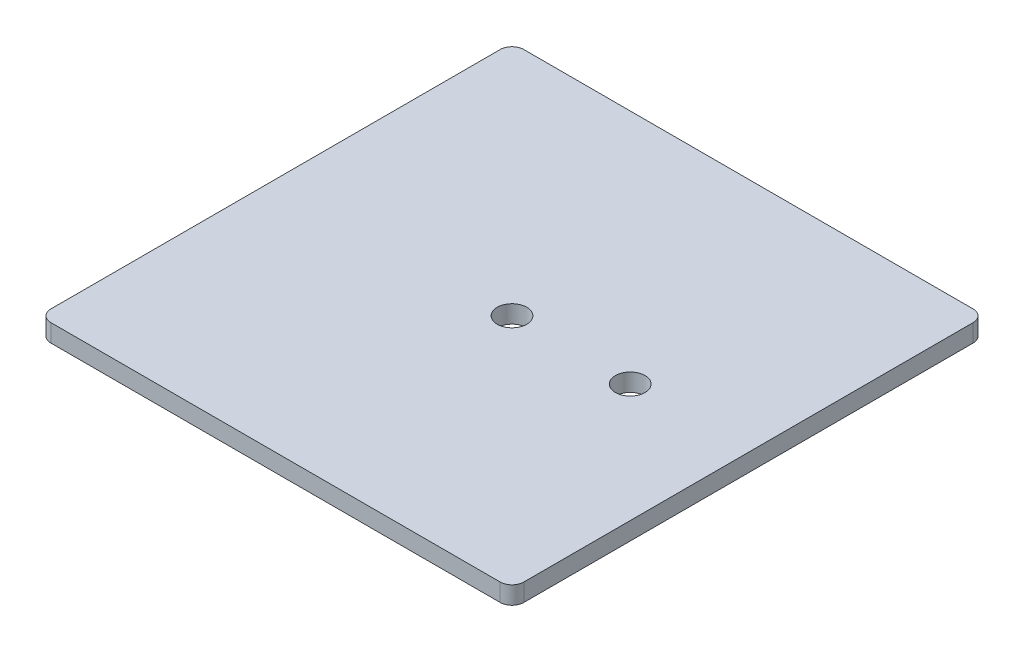
ISO-10303-21;
HEADER;
FILE_DESCRIPTION(('STEP AP214'),'2;1');
FILE_NAME('part.step','',(''),(''),'','','');
FILE_SCHEMA(('AUTOMOTIVE_DESIGN { 1 0 10303 214 1 1 1 1 }'));
ENDSEC;
DATA;
#1=APPLICATION_CONTEXT('core data for automotive mechanical design processes');
#2=APPLICATION_PROTOCOL_DEFINITION('international standard','automotive_design',2000,#1);
#3=PRODUCT_CONTEXT('',#1,'mechanical');
#4=PRODUCT('Part','Part','',(#3));
#5=PRODUCT_RELATED_PRODUCT_CATEGORY('part','',(#4));
#6=PRODUCT_DEFINITION_FORMATION('','',#4);
#7=PRODUCT_DEFINITION_CONTEXT('part definition',#1,'design');
#8=PRODUCT_DEFINITION('design','',#6,#7);
#9=PRODUCT_DEFINITION_SHAPE('','',#8);
#10=(LENGTH_UNIT() NAMED_UNIT(*) SI_UNIT(.MILLI.,.METRE.));
#11=(NAMED_UNIT(*) PLANE_ANGLE_UNIT() SI_UNIT($,.RADIAN.));
#12=(NAMED_UNIT(*) SI_UNIT($,.STERADIAN.) SOLID_ANGLE_UNIT());
#13=UNCERTAINTY_MEASURE_WITH_UNIT(LENGTH_MEASURE(1.E-05),#10,'distance_accuracy_value','');
#14=(GEOMETRIC_REPRESENTATION_CONTEXT(3) GLOBAL_UNCERTAINTY_ASSIGNED_CONTEXT((#13)) GLOBAL_UNIT_ASSIGNED_CONTEXT((#10,
#11,#12)) REPRESENTATION_CONTEXT('',''));
#15=CARTESIAN_POINT('',(0.,0.,0.));
#16=DIRECTION('',(0.,0.,1.));
#17=DIRECTION('',(1.,0.,0.));
#18=AXIS2_PLACEMENT_3D('',#15,#16,#17);
#19=CARTESIAN_POINT('',(0.,3.,-80.));
#20=DIRECTION('',(0.,-1.,0.));
#21=DIRECTION('',(0.,0.,-1.));
#22=AXIS2_PLACEMENT_3D('',#19,#20,#21);
#23=PLANE('',#22);
#24=CARTESIAN_POINT('',(40.,3.,-40.));
#25=DIRECTION('',(0.,1.,0.));
#26=DIRECTION('',(0.,0.,1.));
#27=AXIS2_PLACEMENT_3D('',#24,#25,#26);
#28=CIRCLE('',#27,2.5);
#29=CARTESIAN_POINT('',(40.,3.,-37.5));
#30=VERTEX_POINT('',#29);
#31=EDGE_CURVE('E166',#30,#30,#28,.T.);
#32=ORIENTED_EDGE('',*,*,#31,.F.);
#33=EDGE_LOOP('',(#32));
#34=FACE_BOUND('',#33,.T.);
#35=DIRECTION('',(0.,0.,-1.));
#36=VECTOR('',#35,1.);
#37=CARTESIAN_POINT('',(80.,3.,0.));
#38=LINE('',#37,#36);
#39=CARTESIAN_POINT('',(80.,3.,-2.));
#40=VERTEX_POINT('',#39);
#41=CARTESIAN_POINT('',(80.,3.,-78.));
#42=VERTEX_POINT('',#41);
#43=EDGE_CURVE('E170',#40,#42,#38,.T.);
#44=ORIENTED_EDGE('',*,*,#43,.T.);
#45=CARTESIAN_POINT('',(78.,3.,-78.));
#46=DIRECTION('',(0.,-1.,0.));
#47=DIRECTION('',(0.,0.,-1.));
#48=AXIS2_PLACEMENT_3D('',#45,#46,#47);
#49=CIRCLE('',#48,2.);
#50=CARTESIAN_POINT('',(78.,3.,-80.));
#51=VERTEX_POINT('',#50);
#52=EDGE_CURVE('E147',#42,#51,#49,.F.);
#53=ORIENTED_EDGE('',*,*,#52,.T.);
#54=DIRECTION('',(-1.,0.,0.));
#55=VECTOR('',#54,1.);
#56=CARTESIAN_POINT('',(0.,3.,-80.));
#57=LINE('',#56,#55);
#58=CARTESIAN_POINT('',(2.,3.,-80.));
#59=VERTEX_POINT('',#58);
#60=EDGE_CURVE('E118',#51,#59,#57,.T.);
#61=ORIENTED_EDGE('',*,*,#60,.T.);
#62=CARTESIAN_POINT('',(2.,3.,-78.));
#63=DIRECTION('',(0.,-1.,0.));
#64=DIRECTION('',(0.,0.,-1.));
#65=AXIS2_PLACEMENT_3D('',#62,#63,#64);
#66=CIRCLE('',#65,2.);
#67=CARTESIAN_POINT('',(0.,3.,-78.));
#68=VERTEX_POINT('',#67);
#69=EDGE_CURVE('E143',#59,#68,#66,.F.);
#70=ORIENTED_EDGE('',*,*,#69,.T.);
#71=DIRECTION('',(0.,0.,1.));
#72=VECTOR('',#71,1.);
#73=CARTESIAN_POINT('',(0.,3.,0.));
#74=LINE('',#73,#72);
#75=CARTESIAN_POINT('',(0.,3.,-2.));
#76=VERTEX_POINT('',#75);
#77=EDGE_CURVE('E126',#68,#76,#74,.T.);
#78=ORIENTED_EDGE('',*,*,#77,.T.);
#79=CARTESIAN_POINT('',(2.,3.,-2.));
#80=DIRECTION('',(0.,-1.,0.));
#81=DIRECTION('',(0.,0.,-1.));
#82=AXIS2_PLACEMENT_3D('',#79,#80,#81);
#83=CIRCLE('',#82,2.);
#84=CARTESIAN_POINT('',(2.,3.,0.));
#85=VERTEX_POINT('',#84);
#86=EDGE_CURVE('E53',#76,#85,#83,.F.);
#87=ORIENTED_EDGE('',*,*,#86,.T.);
#88=DIRECTION('',(1.,0.,0.));
#89=VECTOR('',#88,1.);
#90=CARTESIAN_POINT('',(0.,3.,0.));
#91=LINE('',#90,#89);
#92=CARTESIAN_POINT('',(78.,3.,0.));
#93=VERTEX_POINT('',#92);
#94=EDGE_CURVE('E129',#85,#93,#91,.T.);
#95=ORIENTED_EDGE('',*,*,#94,.T.);
#96=CARTESIAN_POINT('',(78.,3.,-2.));
#97=DIRECTION('',(0.,-1.,0.));
#98=DIRECTION('',(0.,0.,-1.));
#99=AXIS2_PLACEMENT_3D('',#96,#97,#98);
#100=CIRCLE('',#99,2.);
#101=EDGE_CURVE('E145',#93,#40,#100,.F.);
#102=ORIENTED_EDGE('',*,*,#101,.T.);
#103=EDGE_LOOP('',(#44,#53,#61,#70,#78,#87,#95,#102));
#104=FACE_BOUND('',#103,.T.);
#105=CARTESIAN_POINT('',(60.,3.,-40.));
#106=DIRECTION('',(0.,1.,0.));
#107=DIRECTION('',(0.,0.,1.));
#108=AXIS2_PLACEMENT_3D('',#105,#106,#107);
#109=CIRCLE('',#108,2.5);
#110=CARTESIAN_POINT('',(60.,3.,-37.5));
#111=VERTEX_POINT('',#110);
#112=EDGE_CURVE('E176',#111,#111,#109,.T.);
#113=ORIENTED_EDGE('',*,*,#112,.F.);
#114=EDGE_LOOP('',(#113));
#115=FACE_BOUND('',#114,.T.);
#116=ADVANCED_FACE('F31',(#34,#104,#115),#23,.F.);
#117=CARTESIAN_POINT('',(0.,0.,-80.));
#118=DIRECTION('',(0.,-1.,0.));
#119=DIRECTION('',(0.,0.,-1.));
#120=AXIS2_PLACEMENT_3D('',#117,#118,#119);
#121=PLANE('',#120);
#122=CARTESIAN_POINT('',(40.,0.,-40.));
#123=DIRECTION('',(0.,1.,0.));
#124=DIRECTION('',(0.,0.,1.));
#125=AXIS2_PLACEMENT_3D('',#122,#123,#124);
#126=CIRCLE('',#125,2.5);
#127=CARTESIAN_POINT('',(40.,0.,-37.5));
#128=VERTEX_POINT('',#127);
#129=EDGE_CURVE('E173',#128,#128,#126,.T.);
#130=ORIENTED_EDGE('',*,*,#129,.T.);
#131=EDGE_LOOP('',(#130));
#132=FACE_BOUND('',#131,.T.);
#133=DIRECTION('',(-1.,0.,0.));
#134=VECTOR('',#133,1.);
#135=CARTESIAN_POINT('',(0.,0.,-80.));
#136=LINE('',#135,#134);
#137=CARTESIAN_POINT('',(78.,0.,-80.));
#138=VERTEX_POINT('',#137);
#139=CARTESIAN_POINT('',(2.,0.,-80.));
#140=VERTEX_POINT('',#139);
#141=EDGE_CURVE('E115',#138,#140,#136,.T.);
#142=ORIENTED_EDGE('',*,*,#141,.F.);
#143=CARTESIAN_POINT('',(78.,0.,-78.));
#144=DIRECTION('',(0.,-1.,0.));
#145=DIRECTION('',(0.,0.,-1.));
#146=AXIS2_PLACEMENT_3D('',#143,#144,#145);
#147=CIRCLE('',#146,2.);
#148=CARTESIAN_POINT('',(80.,0.,-78.));
#149=VERTEX_POINT('',#148);
#150=EDGE_CURVE('E98',#138,#149,#147,.T.);
#151=ORIENTED_EDGE('',*,*,#150,.T.);
#152=DIRECTION('',(0.,0.,-1.));
#153=VECTOR('',#152,1.);
#154=CARTESIAN_POINT('',(80.,0.,0.));
#155=LINE('',#154,#153);
#156=CARTESIAN_POINT('',(80.,0.,-2.));
#157=VERTEX_POINT('',#156);
#158=EDGE_CURVE('E127',#157,#149,#155,.T.);
#159=ORIENTED_EDGE('',*,*,#158,.F.);
#160=CARTESIAN_POINT('',(78.,0.,-2.));
#161=DIRECTION('',(0.,-1.,0.));
#162=DIRECTION('',(0.,0.,-1.));
#163=AXIS2_PLACEMENT_3D('',#160,#161,#162);
#164=CIRCLE('',#163,2.);
#165=CARTESIAN_POINT('',(78.,0.,0.));
#166=VERTEX_POINT('',#165);
#167=EDGE_CURVE('E109',#157,#166,#164,.T.);
#168=ORIENTED_EDGE('',*,*,#167,.T.);
#169=DIRECTION('',(1.,0.,0.));
#170=VECTOR('',#169,1.);
#171=CARTESIAN_POINT('',(0.,0.,0.));
#172=LINE('',#171,#170);
#173=CARTESIAN_POINT('',(2.,0.,0.));
#174=VERTEX_POINT('',#173);
#175=EDGE_CURVE('E131',#174,#166,#172,.T.);
#176=ORIENTED_EDGE('',*,*,#175,.F.);
#177=CARTESIAN_POINT('',(2.,0.,-2.));
#178=DIRECTION('',(0.,-1.,0.));
#179=DIRECTION('',(0.,0.,-1.));
#180=AXIS2_PLACEMENT_3D('',#177,#178,#179);
#181=CIRCLE('',#180,2.);
#182=CARTESIAN_POINT('',(0.,0.,-2.));
#183=VERTEX_POINT('',#182);
#184=EDGE_CURVE('E119',#174,#183,#181,.T.);
#185=ORIENTED_EDGE('',*,*,#184,.T.);
#186=DIRECTION('',(0.,0.,1.));
#187=VECTOR('',#186,1.);
#188=CARTESIAN_POINT('',(0.,0.,0.));
#189=LINE('',#188,#187);
#190=CARTESIAN_POINT('',(0.,0.,-78.));
#191=VERTEX_POINT('',#190);
#192=EDGE_CURVE('E158',#191,#183,#189,.T.);
#193=ORIENTED_EDGE('',*,*,#192,.F.);
#194=CARTESIAN_POINT('',(2.,0.,-78.));
#195=DIRECTION('',(0.,-1.,0.));
#196=DIRECTION('',(0.,0.,-1.));
#197=AXIS2_PLACEMENT_3D('',#194,#195,#196);
#198=CIRCLE('',#197,2.);
#199=EDGE_CURVE('E125',#191,#140,#198,.T.);
#200=ORIENTED_EDGE('',*,*,#199,.T.);
#201=EDGE_LOOP('',(#142,#151,#159,#168,#176,#185,#193,#200));
#202=FACE_BOUND('',#201,.T.);
#203=CARTESIAN_POINT('',(60.,0.,-40.));
#204=DIRECTION('',(0.,1.,0.));
#205=DIRECTION('',(0.,0.,1.));
#206=AXIS2_PLACEMENT_3D('',#203,#204,#205);
#207=CIRCLE('',#206,2.5);
#208=CARTESIAN_POINT('',(60.,0.,-37.5));
#209=VERTEX_POINT('',#208);
#210=EDGE_CURVE('E179',#209,#209,#207,.T.);
#211=ORIENTED_EDGE('',*,*,#210,.T.);
#212=EDGE_LOOP('',(#211));
#213=FACE_BOUND('',#212,.T.);
#214=ADVANCED_FACE('F122',(#132,#202,#213),#121,.T.);
#215=CARTESIAN_POINT('',(0.,3.,0.));
#216=DIRECTION('',(1.,0.,0.));
#217=DIRECTION('',(0.,0.,-1.));
#218=AXIS2_PLACEMENT_3D('',#215,#216,#217);
#219=PLANE('',#218);
#220=ORIENTED_EDGE('',*,*,#77,.F.);
#221=DIRECTION('',(0.,-1.,0.));
#222=VECTOR('',#221,1.);
#223=CARTESIAN_POINT('',(0.,3.,-78.));
#224=LINE('',#223,#222);
#225=EDGE_CURVE('E11',#68,#191,#224,.T.);
#226=ORIENTED_EDGE('',*,*,#225,.T.);
#227=ORIENTED_EDGE('',*,*,#192,.T.);
#228=DIRECTION('',(0.,-1.,0.));
#229=VECTOR('',#228,1.);
#230=CARTESIAN_POINT('',(0.,3.,-2.));
#231=LINE('',#230,#229);
#232=EDGE_CURVE('E39',#183,#76,#231,.F.);
#233=ORIENTED_EDGE('',*,*,#232,.T.);
#234=EDGE_LOOP('',(#220,#226,#227,#233));
#235=FACE_BOUND('',#234,.T.);
#236=ADVANCED_FACE('F156',(#235),#219,.F.);
#237=CARTESIAN_POINT('',(0.,3.,0.));
#238=DIRECTION('',(0.,0.,-1.));
#239=DIRECTION('',(-1.,0.,0.));
#240=AXIS2_PLACEMENT_3D('',#237,#238,#239);
#241=PLANE('',#240);
#242=ORIENTED_EDGE('',*,*,#175,.T.);
#243=DIRECTION('',(0.,-1.,0.));
#244=VECTOR('',#243,1.);
#245=CARTESIAN_POINT('',(78.,3.,0.));
#246=LINE('',#245,#244);
#247=EDGE_CURVE('E46',#166,#93,#246,.F.);
#248=ORIENTED_EDGE('',*,*,#247,.T.);
#249=ORIENTED_EDGE('',*,*,#94,.F.);
#250=DIRECTION('',(0.,-1.,0.));
#251=VECTOR('',#250,1.);
#252=CARTESIAN_POINT('',(2.,3.,0.));
#253=LINE('',#252,#251);
#254=EDGE_CURVE('E149',#85,#174,#253,.T.);
#255=ORIENTED_EDGE('',*,*,#254,.T.);
#256=EDGE_LOOP('',(#242,#248,#249,#255));
#257=FACE_BOUND('',#256,.T.);
#258=ADVANCED_FACE('F165',(#257),#241,.F.);
#259=CARTESIAN_POINT('',(80.,3.,0.));
#260=DIRECTION('',(-1.,0.,0.));
#261=DIRECTION('',(0.,0.,1.));
#262=AXIS2_PLACEMENT_3D('',#259,#260,#261);
#263=PLANE('',#262);
#264=ORIENTED_EDGE('',*,*,#158,.T.);
#265=DIRECTION('',(0.,-1.,0.));
#266=VECTOR('',#265,1.);
#267=CARTESIAN_POINT('',(80.,3.,-78.));
#268=LINE('',#267,#266);
#269=EDGE_CURVE('E103',#149,#42,#268,.F.);
#270=ORIENTED_EDGE('',*,*,#269,.T.);
#271=ORIENTED_EDGE('',*,*,#43,.F.);
#272=DIRECTION('',(0.,-1.,0.));
#273=VECTOR('',#272,1.);
#274=CARTESIAN_POINT('',(80.,3.,-2.));
#275=LINE('',#274,#273);
#276=EDGE_CURVE('E108',#40,#157,#275,.T.);
#277=ORIENTED_EDGE('',*,*,#276,.T.);
#278=EDGE_LOOP('',(#264,#270,#271,#277));
#279=FACE_BOUND('',#278,.T.);
#280=ADVANCED_FACE('F202',(#279),#263,.F.);
#281=CARTESIAN_POINT('',(0.,3.,-80.));
#282=DIRECTION('',(0.,0.,1.));
#283=DIRECTION('',(1.,0.,0.));
#284=AXIS2_PLACEMENT_3D('',#281,#282,#283);
#285=PLANE('',#284);
#286=ORIENTED_EDGE('',*,*,#60,.F.);
#287=DIRECTION('',(0.,-1.,0.));
#288=VECTOR('',#287,1.);
#289=CARTESIAN_POINT('',(78.,3.,-80.));
#290=LINE('',#289,#288);
#291=EDGE_CURVE('E102',#51,#138,#290,.T.);
#292=ORIENTED_EDGE('',*,*,#291,.T.);
#293=ORIENTED_EDGE('',*,*,#141,.T.);
#294=DIRECTION('',(0.,-1.,0.));
#295=VECTOR('',#294,1.);
#296=CARTESIAN_POINT('',(2.,3.,-80.));
#297=LINE('',#296,#295);
#298=EDGE_CURVE('E120',#140,#59,#297,.F.);
#299=ORIENTED_EDGE('',*,*,#298,.T.);
#300=EDGE_LOOP('',(#286,#292,#293,#299));
#301=FACE_BOUND('',#300,.T.);
#302=ADVANCED_FACE('F114',(#301),#285,.F.);
#303=CARTESIAN_POINT('',(40.,3.,-40.));
#304=DIRECTION('',(0.,-1.,0.));
#305=DIRECTION('',(0.,0.,-1.));
#306=AXIS2_PLACEMENT_3D('',#303,#304,#305);
#307=CYLINDRICAL_SURFACE('',#306,2.5);
#308=ORIENTED_EDGE('',*,*,#31,.T.);
#309=EDGE_LOOP('',(#308));
#310=FACE_BOUND('',#309,.T.);
#311=ORIENTED_EDGE('',*,*,#129,.F.);
#312=EDGE_LOOP('',(#311));
#313=FACE_BOUND('',#312,.T.);
#314=ADVANCED_FACE('F197',(#310,#313),#307,.F.);
#315=CARTESIAN_POINT('',(60.,3.,-40.));
#316=DIRECTION('',(0.,-1.,0.));
#317=DIRECTION('',(0.,0.,-1.));
#318=AXIS2_PLACEMENT_3D('',#315,#316,#317);
#319=CYLINDRICAL_SURFACE('',#318,2.5);
#320=ORIENTED_EDGE('',*,*,#112,.T.);
#321=EDGE_LOOP('',(#320));
#322=FACE_BOUND('',#321,.T.);
#323=ORIENTED_EDGE('',*,*,#210,.F.);
#324=EDGE_LOOP('',(#323));
#325=FACE_BOUND('',#324,.T.);
#326=ADVANCED_FACE('F185',(#322,#325),#319,.F.);
#327=CARTESIAN_POINT('',(78.,3.,-78.));
#328=DIRECTION('',(0.,-1.,0.));
#329=DIRECTION('',(0.,0.,-1.));
#330=AXIS2_PLACEMENT_3D('',#327,#328,#329);
#331=CYLINDRICAL_SURFACE('',#330,2.);
#332=ORIENTED_EDGE('',*,*,#52,.F.);
#333=ORIENTED_EDGE('',*,*,#269,.F.);
#334=ORIENTED_EDGE('',*,*,#150,.F.);
#335=ORIENTED_EDGE('',*,*,#291,.F.);
#336=EDGE_LOOP('',(#332,#333,#334,#335));
#337=FACE_BOUND('',#336,.T.);
#338=ADVANCED_FACE('F101',(#337),#331,.T.);
#339=CARTESIAN_POINT('',(78.,3.,-2.));
#340=DIRECTION('',(0.,-1.,0.));
#341=DIRECTION('',(0.,0.,-1.));
#342=AXIS2_PLACEMENT_3D('',#339,#340,#341);
#343=CYLINDRICAL_SURFACE('',#342,2.);
#344=ORIENTED_EDGE('',*,*,#101,.F.);
#345=ORIENTED_EDGE('',*,*,#247,.F.);
#346=ORIENTED_EDGE('',*,*,#167,.F.);
#347=ORIENTED_EDGE('',*,*,#276,.F.);
#348=EDGE_LOOP('',(#344,#345,#346,#347));
#349=FACE_BOUND('',#348,.T.);
#350=ADVANCED_FACE('F212',(#349),#343,.T.);
#351=CARTESIAN_POINT('',(2.,3.,-78.));
#352=DIRECTION('',(0.,-1.,0.));
#353=DIRECTION('',(0.,0.,-1.));
#354=AXIS2_PLACEMENT_3D('',#351,#352,#353);
#355=CYLINDRICAL_SURFACE('',#354,2.);
#356=ORIENTED_EDGE('',*,*,#69,.F.);
#357=ORIENTED_EDGE('',*,*,#298,.F.);
#358=ORIENTED_EDGE('',*,*,#199,.F.);
#359=ORIENTED_EDGE('',*,*,#225,.F.);
#360=EDGE_LOOP('',(#356,#357,#358,#359));
#361=FACE_BOUND('',#360,.T.);
#362=ADVANCED_FACE('F214',(#361),#355,.T.);
#363=CARTESIAN_POINT('',(2.,3.,-2.));
#364=DIRECTION('',(0.,-1.,0.));
#365=DIRECTION('',(0.,0.,-1.));
#366=AXIS2_PLACEMENT_3D('',#363,#364,#365);
#367=CYLINDRICAL_SURFACE('',#366,2.);
#368=ORIENTED_EDGE('',*,*,#86,.F.);
#369=ORIENTED_EDGE('',*,*,#232,.F.);
#370=ORIENTED_EDGE('',*,*,#184,.F.);
#371=ORIENTED_EDGE('',*,*,#254,.F.);
#372=EDGE_LOOP('',(#368,#369,#370,#371));
#373=FACE_BOUND('',#372,.T.);
#374=ADVANCED_FACE('F33',(#373),#367,.T.);
#375=CLOSED_SHELL('',(#116,#214,#236,#258,#280,#302,#314,#326,#338,#350,#362,#374));
#376=MANIFOLD_SOLID_BREP('B2',#375);
#377=ADVANCED_BREP_SHAPE_REPRESENTATION('',(#18,#376),#14);
#378=SHAPE_DEFINITION_REPRESENTATION(#9,#377);
ENDSEC;
END-ISO-10303-21;
